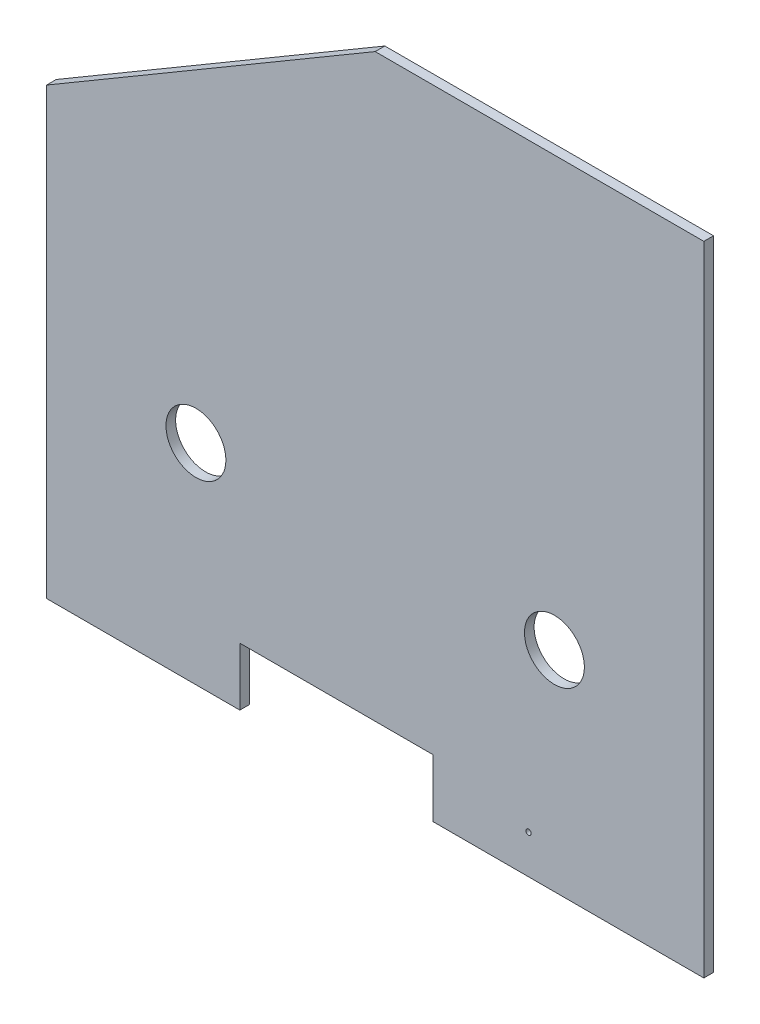
ISO-10303-21;
HEADER;
FILE_DESCRIPTION(('STEP AP214'),'2;1');
FILE_NAME('part.step','',(''),(''),'','','');
FILE_SCHEMA(('AUTOMOTIVE_DESIGN { 1 0 10303 214 1 1 1 1 }'));
ENDSEC;
DATA;
#1=APPLICATION_CONTEXT('core data for automotive mechanical design processes');
#2=APPLICATION_PROTOCOL_DEFINITION('international standard','automotive_design',2000,#1);
#3=PRODUCT_CONTEXT('',#1,'mechanical');
#4=PRODUCT('Part','Part','',(#3));
#5=PRODUCT_RELATED_PRODUCT_CATEGORY('part','',(#4));
#6=PRODUCT_DEFINITION_FORMATION('','',#4);
#7=PRODUCT_DEFINITION_CONTEXT('part definition',#1,'design');
#8=PRODUCT_DEFINITION('design','',#6,#7);
#9=PRODUCT_DEFINITION_SHAPE('','',#8);
#10=(LENGTH_UNIT() NAMED_UNIT(*) SI_UNIT(.MILLI.,.METRE.));
#11=(NAMED_UNIT(*) PLANE_ANGLE_UNIT() SI_UNIT($,.RADIAN.));
#12=(NAMED_UNIT(*) SI_UNIT($,.STERADIAN.) SOLID_ANGLE_UNIT());
#13=UNCERTAINTY_MEASURE_WITH_UNIT(LENGTH_MEASURE(1.E-05),#10,'distance_accuracy_value','');
#14=(GEOMETRIC_REPRESENTATION_CONTEXT(3) GLOBAL_UNCERTAINTY_ASSIGNED_CONTEXT((#13)) GLOBAL_UNIT_ASSIGNED_CONTEXT((#10,
#11,#12)) REPRESENTATION_CONTEXT('',''));
#15=CARTESIAN_POINT('',(0.,0.,0.));
#16=DIRECTION('',(0.,0.,1.));
#17=DIRECTION('',(1.,0.,0.));
#18=AXIS2_PLACEMENT_3D('',#15,#16,#17);
#19=CARTESIAN_POINT('',(431.8,12.7,6.35));
#20=DIRECTION('',(-1.,0.,0.));
#21=DIRECTION('',(0.,-1.,0.));
#22=AXIS2_PLACEMENT_3D('',#19,#20,#21);
#23=PLANE('',#22);
#24=DIRECTION('',(0.,1.,0.));
#25=VECTOR('',#24,1.);
#26=CARTESIAN_POINT('',(431.8,12.7,0.));
#27=LINE('',#26,#25);
#28=CARTESIAN_POINT('',(431.8,12.7,0.));
#29=VERTEX_POINT('',#28);
#30=CARTESIAN_POINT('',(431.8,431.8,0.));
#31=VERTEX_POINT('',#30);
#32=EDGE_CURVE('E135',#29,#31,#27,.T.);
#33=ORIENTED_EDGE('',*,*,#32,.T.);
#34=DIRECTION('',(0.,0.,-1.));
#35=VECTOR('',#34,1.);
#36=CARTESIAN_POINT('',(431.8,431.8,6.35));
#37=LINE('',#36,#35);
#38=CARTESIAN_POINT('',(431.8,431.8,6.35));
#39=VERTEX_POINT('',#38);
#40=EDGE_CURVE('E11',#39,#31,#37,.T.);
#41=ORIENTED_EDGE('',*,*,#40,.F.);
#42=DIRECTION('',(0.,1.,0.));
#43=VECTOR('',#42,1.);
#44=CARTESIAN_POINT('',(431.8,12.7,6.35));
#45=LINE('',#44,#43);
#46=CARTESIAN_POINT('',(431.8,12.7,6.35));
#47=VERTEX_POINT('',#46);
#48=EDGE_CURVE('E152',#47,#39,#45,.T.);
#49=ORIENTED_EDGE('',*,*,#48,.F.);
#50=DIRECTION('',(0.,0.,-1.));
#51=VECTOR('',#50,1.);
#52=CARTESIAN_POINT('',(431.8,12.7,6.35));
#53=LINE('',#52,#51);
#54=EDGE_CURVE('E131',#47,#29,#53,.T.);
#55=ORIENTED_EDGE('',*,*,#54,.T.);
#56=EDGE_LOOP('',(#33,#41,#49,#55));
#57=FACE_BOUND('',#56,.T.);
#58=ADVANCED_FACE('F33',(#57),#23,.F.);
#59=CARTESIAN_POINT('',(215.9,431.8,6.35));
#60=DIRECTION('',(0.,-1.,0.));
#61=DIRECTION('',(0.,0.,-1.));
#62=AXIS2_PLACEMENT_3D('',#59,#60,#61);
#63=PLANE('',#62);
#64=DIRECTION('',(-1.,0.,0.));
#65=VECTOR('',#64,1.);
#66=CARTESIAN_POINT('',(215.9,431.8,0.));
#67=LINE('',#66,#65);
#68=CARTESIAN_POINT('',(215.9,431.8,0.));
#69=VERTEX_POINT('',#68);
#70=EDGE_CURVE('E138',#31,#69,#67,.T.);
#71=ORIENTED_EDGE('',*,*,#70,.T.);
#72=DIRECTION('',(0.,0.,-1.));
#73=VECTOR('',#72,1.);
#74=CARTESIAN_POINT('',(215.9,431.8,6.35));
#75=LINE('',#74,#73);
#76=CARTESIAN_POINT('',(215.9,431.8,6.35));
#77=VERTEX_POINT('',#76);
#78=EDGE_CURVE('E41',#77,#69,#75,.T.);
#79=ORIENTED_EDGE('',*,*,#78,.F.);
#80=DIRECTION('',(-1.,0.,0.));
#81=VECTOR('',#80,1.);
#82=CARTESIAN_POINT('',(215.9,431.8,6.35));
#83=LINE('',#82,#81);
#84=EDGE_CURVE('E95',#39,#77,#83,.T.);
#85=ORIENTED_EDGE('',*,*,#84,.F.);
#86=ORIENTED_EDGE('',*,*,#40,.T.);
#87=EDGE_LOOP('',(#71,#79,#85,#86));
#88=FACE_BOUND('',#87,.T.);
#89=ADVANCED_FACE('F241',(#88),#63,.F.);
#90=CARTESIAN_POINT('',(0.,304.8,6.35));
#91=DIRECTION('',(0.507020126563394,-0.861934215157769,0.));
#92=DIRECTION('',(0.86193421515777,0.507020126563394,0.));
#93=AXIS2_PLACEMENT_3D('',#90,#91,#92);
#94=PLANE('',#93);
#95=DIRECTION('',(-0.861934215157769,-0.507020126563394,0.));
#96=VECTOR('',#95,1.);
#97=CARTESIAN_POINT('',(0.,304.8,0.));
#98=LINE('',#97,#96);
#99=CARTESIAN_POINT('',(0.,304.8,0.));
#100=VERTEX_POINT('',#99);
#101=EDGE_CURVE('E141',#69,#100,#98,.T.);
#102=ORIENTED_EDGE('',*,*,#101,.T.);
#103=DIRECTION('',(0.,0.,-1.));
#104=VECTOR('',#103,1.);
#105=CARTESIAN_POINT('',(0.,304.8,6.35));
#106=LINE('',#105,#104);
#107=CARTESIAN_POINT('',(0.,304.8,6.35));
#108=VERTEX_POINT('',#107);
#109=EDGE_CURVE('E162',#108,#100,#106,.T.);
#110=ORIENTED_EDGE('',*,*,#109,.F.);
#111=DIRECTION('',(-0.861934215157769,-0.507020126563394,0.));
#112=VECTOR('',#111,1.);
#113=CARTESIAN_POINT('',(0.,304.8,6.35));
#114=LINE('',#113,#112);
#115=EDGE_CURVE('E170',#77,#108,#114,.T.);
#116=ORIENTED_EDGE('',*,*,#115,.F.);
#117=ORIENTED_EDGE('',*,*,#78,.T.);
#118=EDGE_LOOP('',(#102,#110,#116,#117));
#119=FACE_BOUND('',#118,.T.);
#120=ADVANCED_FACE('F168',(#119),#94,.F.);
#121=CARTESIAN_POINT('',(0.,304.8,6.35));
#122=DIRECTION('',(1.,0.,0.));
#123=DIRECTION('',(0.,1.,0.));
#124=AXIS2_PLACEMENT_3D('',#121,#122,#123);
#125=PLANE('',#124);
#126=DIRECTION('',(0.,-1.,0.));
#127=VECTOR('',#126,1.);
#128=CARTESIAN_POINT('',(0.,304.8,0.));
#129=LINE('',#128,#127);
#130=CARTESIAN_POINT('',(0.,12.7,0.));
#131=VERTEX_POINT('',#130);
#132=EDGE_CURVE('E143',#100,#131,#129,.T.);
#133=ORIENTED_EDGE('',*,*,#132,.T.);
#134=DIRECTION('',(0.,0.,-1.));
#135=VECTOR('',#134,1.);
#136=CARTESIAN_POINT('',(0.,12.7,6.35));
#137=LINE('',#136,#135);
#138=CARTESIAN_POINT('',(0.,12.7,6.35));
#139=VERTEX_POINT('',#138);
#140=EDGE_CURVE('E159',#139,#131,#137,.T.);
#141=ORIENTED_EDGE('',*,*,#140,.F.);
#142=DIRECTION('',(0.,-1.,0.));
#143=VECTOR('',#142,1.);
#144=CARTESIAN_POINT('',(0.,304.8,6.35));
#145=LINE('',#144,#143);
#146=EDGE_CURVE('E186',#108,#139,#145,.T.);
#147=ORIENTED_EDGE('',*,*,#146,.F.);
#148=ORIENTED_EDGE('',*,*,#109,.T.);
#149=EDGE_LOOP('',(#133,#141,#147,#148));
#150=FACE_BOUND('',#149,.T.);
#151=ADVANCED_FACE('F179',(#150),#125,.F.);
#152=CARTESIAN_POINT('',(0.,12.7,6.35));
#153=DIRECTION('',(0.,1.,0.));
#154=DIRECTION('',(-1.,0.,0.));
#155=AXIS2_PLACEMENT_3D('',#152,#153,#154);
#156=PLANE('',#155);
#157=DIRECTION('',(1.,0.,0.));
#158=VECTOR('',#157,1.);
#159=CARTESIAN_POINT('',(0.,12.7,0.));
#160=LINE('',#159,#158);
#161=CARTESIAN_POINT('',(127.,12.7,0.));
#162=VERTEX_POINT('',#161);
#163=EDGE_CURVE('E145',#131,#162,#160,.T.);
#164=ORIENTED_EDGE('',*,*,#163,.T.);
#165=DIRECTION('',(0.,0.,-1.));
#166=VECTOR('',#165,1.);
#167=CARTESIAN_POINT('',(127.,12.7,6.35));
#168=LINE('',#167,#166);
#169=CARTESIAN_POINT('',(127.,12.7,6.35));
#170=VERTEX_POINT('',#169);
#171=EDGE_CURVE('E156',#170,#162,#168,.T.);
#172=ORIENTED_EDGE('',*,*,#171,.F.);
#173=DIRECTION('',(1.,0.,0.));
#174=VECTOR('',#173,1.);
#175=CARTESIAN_POINT('',(0.,12.7,6.35));
#176=LINE('',#175,#174);
#177=EDGE_CURVE('E185',#139,#170,#176,.T.);
#178=ORIENTED_EDGE('',*,*,#177,.F.);
#179=ORIENTED_EDGE('',*,*,#140,.T.);
#180=EDGE_LOOP('',(#164,#172,#178,#179));
#181=FACE_BOUND('',#180,.T.);
#182=ADVANCED_FACE('F183',(#181),#156,.F.);
#183=CARTESIAN_POINT('',(127.,12.7,6.35));
#184=DIRECTION('',(-1.,0.,0.));
#185=DIRECTION('',(0.,0.,1.));
#186=AXIS2_PLACEMENT_3D('',#183,#184,#185);
#187=PLANE('',#186);
#188=DIRECTION('',(0.,1.,0.));
#189=VECTOR('',#188,1.);
#190=CARTESIAN_POINT('',(127.,12.7,0.));
#191=LINE('',#190,#189);
#192=CARTESIAN_POINT('',(127.,50.8,0.));
#193=VERTEX_POINT('',#192);
#194=EDGE_CURVE('E147',#162,#193,#191,.T.);
#195=ORIENTED_EDGE('',*,*,#194,.T.);
#196=DIRECTION('',(0.,0.,-1.));
#197=VECTOR('',#196,1.);
#198=CARTESIAN_POINT('',(127.,50.8,6.35));
#199=LINE('',#198,#197);
#200=CARTESIAN_POINT('',(127.,50.8,6.35));
#201=VERTEX_POINT('',#200);
#202=EDGE_CURVE('E126',#201,#193,#199,.T.);
#203=ORIENTED_EDGE('',*,*,#202,.F.);
#204=DIRECTION('',(0.,1.,0.));
#205=VECTOR('',#204,1.);
#206=CARTESIAN_POINT('',(127.,12.7,6.35));
#207=LINE('',#206,#205);
#208=EDGE_CURVE('E117',#170,#201,#207,.T.);
#209=ORIENTED_EDGE('',*,*,#208,.F.);
#210=ORIENTED_EDGE('',*,*,#171,.T.);
#211=EDGE_LOOP('',(#195,#203,#209,#210));
#212=FACE_BOUND('',#211,.T.);
#213=ADVANCED_FACE('F249',(#212),#187,.F.);
#214=CARTESIAN_POINT('',(254.,50.8,6.35));
#215=DIRECTION('',(0.,1.,0.));
#216=DIRECTION('',(-1.,0.,0.));
#217=AXIS2_PLACEMENT_3D('',#214,#215,#216);
#218=PLANE('',#217);
#219=DIRECTION('',(1.,0.,0.));
#220=VECTOR('',#219,1.);
#221=CARTESIAN_POINT('',(254.,50.8,0.));
#222=LINE('',#221,#220);
#223=CARTESIAN_POINT('',(254.,50.8,0.));
#224=VERTEX_POINT('',#223);
#225=EDGE_CURVE('E125',#193,#224,#222,.T.);
#226=ORIENTED_EDGE('',*,*,#225,.T.);
#227=DIRECTION('',(0.,0.,-1.));
#228=VECTOR('',#227,1.);
#229=CARTESIAN_POINT('',(254.,50.8,6.35));
#230=LINE('',#229,#228);
#231=CARTESIAN_POINT('',(254.,50.8,6.35));
#232=VERTEX_POINT('',#231);
#233=EDGE_CURVE('E122',#232,#224,#230,.T.);
#234=ORIENTED_EDGE('',*,*,#233,.F.);
#235=DIRECTION('',(1.,0.,0.));
#236=VECTOR('',#235,1.);
#237=CARTESIAN_POINT('',(254.,50.8,6.35));
#238=LINE('',#237,#236);
#239=EDGE_CURVE('E111',#201,#232,#238,.T.);
#240=ORIENTED_EDGE('',*,*,#239,.F.);
#241=ORIENTED_EDGE('',*,*,#202,.T.);
#242=EDGE_LOOP('',(#226,#234,#240,#241));
#243=FACE_BOUND('',#242,.T.);
#244=ADVANCED_FACE('F123',(#243),#218,.F.);
#245=CARTESIAN_POINT('',(254.,50.8,6.35));
#246=DIRECTION('',(1.,0.,0.));
#247=DIRECTION('',(0.,1.,0.));
#248=AXIS2_PLACEMENT_3D('',#245,#246,#247);
#249=PLANE('',#248);
#250=DIRECTION('',(0.,-1.,0.));
#251=VECTOR('',#250,1.);
#252=CARTESIAN_POINT('',(254.,50.8,0.));
#253=LINE('',#252,#251);
#254=CARTESIAN_POINT('',(254.,12.7,0.));
#255=VERTEX_POINT('',#254);
#256=EDGE_CURVE('E81',#224,#255,#253,.T.);
#257=ORIENTED_EDGE('',*,*,#256,.T.);
#258=DIRECTION('',(0.,0.,-1.));
#259=VECTOR('',#258,1.);
#260=CARTESIAN_POINT('',(254.,12.7,6.35));
#261=LINE('',#260,#259);
#262=CARTESIAN_POINT('',(254.,12.7,6.35));
#263=VERTEX_POINT('',#262);
#264=EDGE_CURVE('E127',#263,#255,#261,.T.);
#265=ORIENTED_EDGE('',*,*,#264,.F.);
#266=DIRECTION('',(0.,-1.,0.));
#267=VECTOR('',#266,1.);
#268=CARTESIAN_POINT('',(254.,50.8,6.35));
#269=LINE('',#268,#267);
#270=EDGE_CURVE('E115',#232,#263,#269,.T.);
#271=ORIENTED_EDGE('',*,*,#270,.F.);
#272=ORIENTED_EDGE('',*,*,#233,.T.);
#273=EDGE_LOOP('',(#257,#265,#271,#272));
#274=FACE_BOUND('',#273,.T.);
#275=ADVANCED_FACE('F129',(#274),#249,.F.);
#276=CARTESIAN_POINT('',(254.,12.7,6.35));
#277=DIRECTION('',(0.,1.,0.));
#278=DIRECTION('',(-1.,0.,0.));
#279=AXIS2_PLACEMENT_3D('',#276,#277,#278);
#280=PLANE('',#279);
#281=DIRECTION('',(1.,0.,0.));
#282=VECTOR('',#281,1.);
#283=CARTESIAN_POINT('',(254.,12.7,0.));
#284=LINE('',#283,#282);
#285=EDGE_CURVE('E87',#255,#29,#284,.T.);
#286=ORIENTED_EDGE('',*,*,#285,.T.);
#287=ORIENTED_EDGE('',*,*,#54,.F.);
#288=DIRECTION('',(1.,0.,0.));
#289=VECTOR('',#288,1.);
#290=CARTESIAN_POINT('',(254.,12.7,6.35));
#291=LINE('',#290,#289);
#292=EDGE_CURVE('E49',#263,#47,#291,.T.);
#293=ORIENTED_EDGE('',*,*,#292,.F.);
#294=ORIENTED_EDGE('',*,*,#264,.T.);
#295=EDGE_LOOP('',(#286,#287,#293,#294));
#296=FACE_BOUND('',#295,.T.);
#297=ADVANCED_FACE('F222',(#296),#280,.F.);
#298=CARTESIAN_POINT('',(0.,0.,6.35));
#299=DIRECTION('',(0.,0.,-1.));
#300=DIRECTION('',(-1.,0.,0.));
#301=AXIS2_PLACEMENT_3D('',#298,#299,#300);
#302=PLANE('',#301);
#303=CARTESIAN_POINT('',(316.66767894312,38.1,6.35));
#304=DIRECTION('',(0.,0.,1.));
#305=DIRECTION('',(1.,0.,0.));
#306=AXIS2_PLACEMENT_3D('',#303,#304,#305);
#307=CIRCLE('',#306,1.74999999999998);
#308=CARTESIAN_POINT('',(318.41767894312,38.1,6.35));
#309=VERTEX_POINT('',#308);
#310=EDGE_CURVE('E205',#309,#309,#307,.T.);
#311=ORIENTED_EDGE('',*,*,#310,.F.);
#312=EDGE_LOOP('',(#311));
#313=FACE_BOUND('',#312,.T.);
#314=CARTESIAN_POINT('',(333.65,150.3,6.35));
#315=DIRECTION('',(0.,0.,1.));
#316=DIRECTION('',(1.,0.,0.));
#317=AXIS2_PLACEMENT_3D('',#314,#315,#316);
#318=CIRCLE('',#317,19.685);
#319=CARTESIAN_POINT('',(353.335,150.3,6.35));
#320=VERTEX_POINT('',#319);
#321=EDGE_CURVE('E199',#320,#320,#318,.T.);
#322=ORIENTED_EDGE('',*,*,#321,.F.);
#323=EDGE_LOOP('',(#322));
#324=FACE_BOUND('',#323,.T.);
#325=CARTESIAN_POINT('',(98.15,150.3,6.35));
#326=DIRECTION('',(0.,0.,1.));
#327=DIRECTION('',(1.,0.,0.));
#328=AXIS2_PLACEMENT_3D('',#325,#326,#327);
#329=CIRCLE('',#328,19.685);
#330=CARTESIAN_POINT('',(117.835,150.3,6.35));
#331=VERTEX_POINT('',#330);
#332=EDGE_CURVE('E193',#331,#331,#329,.T.);
#333=ORIENTED_EDGE('',*,*,#332,.F.);
#334=EDGE_LOOP('',(#333));
#335=FACE_BOUND('',#334,.T.);
#336=ORIENTED_EDGE('',*,*,#48,.T.);
#337=ORIENTED_EDGE('',*,*,#84,.T.);
#338=ORIENTED_EDGE('',*,*,#115,.T.);
#339=ORIENTED_EDGE('',*,*,#146,.T.);
#340=ORIENTED_EDGE('',*,*,#177,.T.);
#341=ORIENTED_EDGE('',*,*,#208,.T.);
#342=ORIENTED_EDGE('',*,*,#239,.T.);
#343=ORIENTED_EDGE('',*,*,#270,.T.);
#344=ORIENTED_EDGE('',*,*,#292,.T.);
#345=EDGE_LOOP('',(#336,#337,#338,#339,#340,#341,#342,#343,#344));
#346=FACE_BOUND('',#345,.T.);
#347=ADVANCED_FACE('F113',(#313,#324,#335,#346),#302,.F.);
#348=CARTESIAN_POINT('',(0.,0.,0.));
#349=DIRECTION('',(0.,0.,-1.));
#350=DIRECTION('',(-1.,0.,0.));
#351=AXIS2_PLACEMENT_3D('',#348,#349,#350);
#352=PLANE('',#351);
#353=CARTESIAN_POINT('',(316.66767894312,38.1,0.));
#354=DIRECTION('',(0.,0.,1.));
#355=DIRECTION('',(1.,0.,0.));
#356=AXIS2_PLACEMENT_3D('',#353,#354,#355);
#357=CIRCLE('',#356,1.74999999999998);
#358=CARTESIAN_POINT('',(318.41767894312,38.1,0.));
#359=VERTEX_POINT('',#358);
#360=EDGE_CURVE('E202',#359,#359,#357,.T.);
#361=ORIENTED_EDGE('',*,*,#360,.T.);
#362=EDGE_LOOP('',(#361));
#363=FACE_BOUND('',#362,.T.);
#364=CARTESIAN_POINT('',(333.65,150.3,0.));
#365=DIRECTION('',(0.,0.,1.));
#366=DIRECTION('',(1.,0.,0.));
#367=AXIS2_PLACEMENT_3D('',#364,#365,#366);
#368=CIRCLE('',#367,19.685);
#369=CARTESIAN_POINT('',(353.335,150.3,0.));
#370=VERTEX_POINT('',#369);
#371=EDGE_CURVE('E196',#370,#370,#368,.T.);
#372=ORIENTED_EDGE('',*,*,#371,.T.);
#373=EDGE_LOOP('',(#372));
#374=FACE_BOUND('',#373,.T.);
#375=CARTESIAN_POINT('',(98.15,150.3,0.));
#376=DIRECTION('',(0.,0.,1.));
#377=DIRECTION('',(1.,0.,0.));
#378=AXIS2_PLACEMENT_3D('',#375,#376,#377);
#379=CIRCLE('',#378,19.685);
#380=CARTESIAN_POINT('',(117.835,150.3,0.));
#381=VERTEX_POINT('',#380);
#382=EDGE_CURVE('E139',#381,#381,#379,.T.);
#383=ORIENTED_EDGE('',*,*,#382,.T.);
#384=EDGE_LOOP('',(#383));
#385=FACE_BOUND('',#384,.T.);
#386=ORIENTED_EDGE('',*,*,#32,.F.);
#387=ORIENTED_EDGE('',*,*,#285,.F.);
#388=ORIENTED_EDGE('',*,*,#256,.F.);
#389=ORIENTED_EDGE('',*,*,#225,.F.);
#390=ORIENTED_EDGE('',*,*,#194,.F.);
#391=ORIENTED_EDGE('',*,*,#163,.F.);
#392=ORIENTED_EDGE('',*,*,#132,.F.);
#393=ORIENTED_EDGE('',*,*,#101,.F.);
#394=ORIENTED_EDGE('',*,*,#70,.F.);
#395=EDGE_LOOP('',(#386,#387,#388,#389,#390,#391,#392,#393,#394));
#396=FACE_BOUND('',#395,.T.);
#397=ADVANCED_FACE('F174',(#363,#374,#385,#396),#352,.T.);
#398=CARTESIAN_POINT('',(98.15,150.3,0.));
#399=DIRECTION('',(0.,0.,1.));
#400=DIRECTION('',(1.,0.,0.));
#401=AXIS2_PLACEMENT_3D('',#398,#399,#400);
#402=CYLINDRICAL_SURFACE('',#401,19.685);
#403=ORIENTED_EDGE('',*,*,#382,.F.);
#404=EDGE_LOOP('',(#403));
#405=FACE_BOUND('',#404,.T.);
#406=ORIENTED_EDGE('',*,*,#332,.T.);
#407=EDGE_LOOP('',(#406));
#408=FACE_BOUND('',#407,.T.);
#409=ADVANCED_FACE('F228',(#405,#408),#402,.F.);
#410=CARTESIAN_POINT('',(333.65,150.3,0.));
#411=DIRECTION('',(0.,0.,1.));
#412=DIRECTION('',(1.,0.,0.));
#413=AXIS2_PLACEMENT_3D('',#410,#411,#412);
#414=CYLINDRICAL_SURFACE('',#413,19.685);
#415=ORIENTED_EDGE('',*,*,#371,.F.);
#416=EDGE_LOOP('',(#415));
#417=FACE_BOUND('',#416,.T.);
#418=ORIENTED_EDGE('',*,*,#321,.T.);
#419=EDGE_LOOP('',(#418));
#420=FACE_BOUND('',#419,.T.);
#421=ADVANCED_FACE('F216',(#417,#420),#414,.F.);
#422=CARTESIAN_POINT('',(316.66767894312,38.1,0.));
#423=DIRECTION('',(0.,0.,1.));
#424=DIRECTION('',(1.,0.,0.));
#425=AXIS2_PLACEMENT_3D('',#422,#423,#424);
#426=CYLINDRICAL_SURFACE('',#425,1.74999999999998);
#427=ORIENTED_EDGE('',*,*,#360,.F.);
#428=EDGE_LOOP('',(#427));
#429=FACE_BOUND('',#428,.T.);
#430=ORIENTED_EDGE('',*,*,#310,.T.);
#431=EDGE_LOOP('',(#430));
#432=FACE_BOUND('',#431,.T.);
#433=ADVANCED_FACE('F213',(#429,#432),#426,.F.);
#434=CLOSED_SHELL('',(#58,#89,#120,#151,#182,#213,#244,#275,#297,#347,#397,#409,#421,#433));
#435=MANIFOLD_SOLID_BREP('B2',#434);
#436=ADVANCED_BREP_SHAPE_REPRESENTATION('',(#18,#435),#14);
#437=SHAPE_DEFINITION_REPRESENTATION(#9,#436);
ENDSEC;
END-ISO-10303-21;
